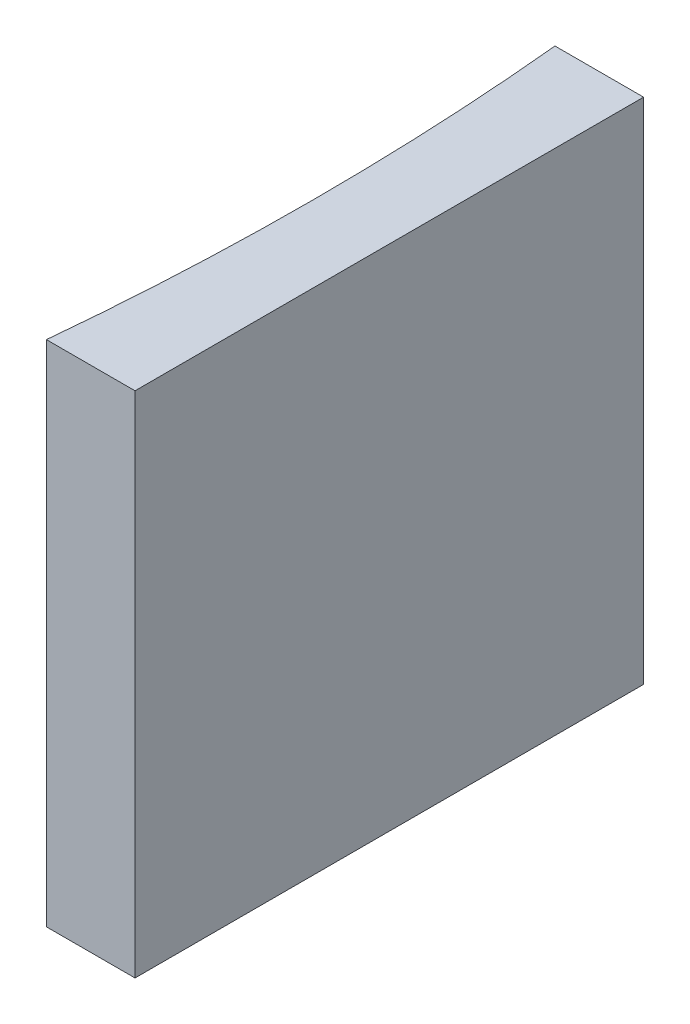
ISO-10303-21;
HEADER;
FILE_DESCRIPTION(('STEP AP214'),'2;1');
FILE_NAME('part.step','',(''),(''),'','','');
FILE_SCHEMA(('AUTOMOTIVE_DESIGN { 1 0 10303 214 1 1 1 1 }'));
ENDSEC;
DATA;
#1=APPLICATION_CONTEXT('core data for automotive mechanical design processes');
#2=APPLICATION_PROTOCOL_DEFINITION('international standard','automotive_design',2000,#1);
#3=PRODUCT_CONTEXT('',#1,'mechanical');
#4=PRODUCT('Part','Part','',(#3));
#5=PRODUCT_RELATED_PRODUCT_CATEGORY('part','',(#4));
#6=PRODUCT_DEFINITION_FORMATION('','',#4);
#7=PRODUCT_DEFINITION_CONTEXT('part definition',#1,'design');
#8=PRODUCT_DEFINITION('design','',#6,#7);
#9=PRODUCT_DEFINITION_SHAPE('','',#8);
#10=(LENGTH_UNIT() NAMED_UNIT(*) SI_UNIT(.MILLI.,.METRE.));
#11=(NAMED_UNIT(*) PLANE_ANGLE_UNIT() SI_UNIT($,.RADIAN.));
#12=(NAMED_UNIT(*) SI_UNIT($,.STERADIAN.) SOLID_ANGLE_UNIT());
#13=UNCERTAINTY_MEASURE_WITH_UNIT(LENGTH_MEASURE(1.E-05),#10,'distance_accuracy_value','');
#14=(GEOMETRIC_REPRESENTATION_CONTEXT(3) GLOBAL_UNCERTAINTY_ASSIGNED_CONTEXT((#13)) GLOBAL_UNIT_ASSIGNED_CONTEXT((#10,
#11,#12)) REPRESENTATION_CONTEXT('',''));
#15=CARTESIAN_POINT('',(0.,0.,0.));
#16=DIRECTION('',(0.,0.,1.));
#17=DIRECTION('',(1.,0.,0.));
#18=AXIS2_PLACEMENT_3D('',#15,#16,#17);
#19=CARTESIAN_POINT('',(0.,20.,0.));
#20=DIRECTION('',(0.,0.,1.));
#21=DIRECTION('',(1.,0.,0.));
#22=AXIS2_PLACEMENT_3D('',#19,#20,#21);
#23=PLANE('',#22);
#24=DIRECTION('',(-1.,0.,0.));
#25=VECTOR('',#24,1.);
#26=CARTESIAN_POINT('',(0.,0.,0.));
#27=LINE('',#26,#25);
#28=CARTESIAN_POINT('',(0.,0.,0.));
#29=VERTEX_POINT('',#28);
#30=CARTESIAN_POINT('',(-3.4846950157558,0.,0.));
#31=VERTEX_POINT('',#30);
#32=EDGE_CURVE('E100',#29,#31,#27,.T.);
#33=ORIENTED_EDGE('',*,*,#32,.T.);
#34=DIRECTION('',(0.,-1.,0.));
#35=VECTOR('',#34,1.);
#36=CARTESIAN_POINT('',(-3.4846950157558,20.,0.));
#37=LINE('',#36,#35);
#38=CARTESIAN_POINT('',(-3.4846950157558,20.,0.));
#39=VERTEX_POINT('',#38);
#40=EDGE_CURVE('E11',#39,#31,#37,.T.);
#41=ORIENTED_EDGE('',*,*,#40,.F.);
#42=DIRECTION('',(-1.,0.,0.));
#43=VECTOR('',#42,1.);
#44=CARTESIAN_POINT('',(0.,20.,0.));
#45=LINE('',#44,#43);
#46=CARTESIAN_POINT('',(0.,20.,0.));
#47=VERTEX_POINT('',#46);
#48=EDGE_CURVE('E88',#47,#39,#45,.T.);
#49=ORIENTED_EDGE('',*,*,#48,.F.);
#50=DIRECTION('',(0.,-1.,0.));
#51=VECTOR('',#50,1.);
#52=CARTESIAN_POINT('',(0.,20.,0.));
#53=LINE('',#52,#51);
#54=EDGE_CURVE('E96',#47,#29,#53,.T.);
#55=ORIENTED_EDGE('',*,*,#54,.T.);
#56=EDGE_LOOP('',(#33,#41,#49,#55));
#57=FACE_BOUND('',#56,.T.);
#58=ADVANCED_FACE('F37',(#57),#23,.F.);
#59=CARTESIAN_POINT('',(-106.4,20.,10.));
#60=DIRECTION('',(0.,-1.,0.));
#61=DIRECTION('',(0.,0.,-1.));
#62=AXIS2_PLACEMENT_3D('',#59,#60,#61);
#63=CYLINDRICAL_SURFACE('',#62,103.4);
#64=CARTESIAN_POINT('',(-106.4,0.,10.));
#65=DIRECTION('',(0.,-1.,0.));
#66=DIRECTION('',(0.,0.,1.));
#67=AXIS2_PLACEMENT_3D('',#64,#65,#66);
#68=CIRCLE('',#67,103.4);
#69=CARTESIAN_POINT('',(-3.4846950157558,0.,20.));
#70=VERTEX_POINT('',#69);
#71=EDGE_CURVE('E92',#31,#70,#68,.T.);
#72=ORIENTED_EDGE('',*,*,#71,.T.);
#73=DIRECTION('',(0.,-1.,0.));
#74=VECTOR('',#73,1.);
#75=CARTESIAN_POINT('',(-3.4846950157558,20.,20.));
#76=LINE('',#75,#74);
#77=CARTESIAN_POINT('',(-3.4846950157558,20.,20.));
#78=VERTEX_POINT('',#77);
#79=EDGE_CURVE('E45',#78,#70,#76,.T.);
#80=ORIENTED_EDGE('',*,*,#79,.F.);
#81=CARTESIAN_POINT('',(-106.4,20.,10.));
#82=DIRECTION('',(0.,-1.,0.));
#83=DIRECTION('',(0.,0.,1.));
#84=AXIS2_PLACEMENT_3D('',#81,#82,#83);
#85=CIRCLE('',#84,103.4);
#86=EDGE_CURVE('E83',#39,#78,#85,.T.);
#87=ORIENTED_EDGE('',*,*,#86,.F.);
#88=ORIENTED_EDGE('',*,*,#40,.T.);
#89=EDGE_LOOP('',(#72,#80,#87,#88));
#90=FACE_BOUND('',#89,.T.);
#91=ADVANCED_FACE('F91',(#90),#63,.F.);
#92=CARTESIAN_POINT('',(0.,20.,20.));
#93=DIRECTION('',(0.,0.,-1.));
#94=DIRECTION('',(-1.,0.,0.));
#95=AXIS2_PLACEMENT_3D('',#92,#93,#94);
#96=PLANE('',#95);
#97=DIRECTION('',(1.,0.,0.));
#98=VECTOR('',#97,1.);
#99=CARTESIAN_POINT('',(0.,0.,20.));
#100=LINE('',#99,#98);
#101=CARTESIAN_POINT('',(0.,0.,20.));
#102=VERTEX_POINT('',#101);
#103=EDGE_CURVE('E70',#70,#102,#100,.T.);
#104=ORIENTED_EDGE('',*,*,#103,.T.);
#105=DIRECTION('',(0.,-1.,0.));
#106=VECTOR('',#105,1.);
#107=CARTESIAN_POINT('',(0.,20.,20.));
#108=LINE('',#107,#106);
#109=CARTESIAN_POINT('',(0.,20.,20.));
#110=VERTEX_POINT('',#109);
#111=EDGE_CURVE('E93',#110,#102,#108,.T.);
#112=ORIENTED_EDGE('',*,*,#111,.F.);
#113=DIRECTION('',(1.,0.,0.));
#114=VECTOR('',#113,1.);
#115=CARTESIAN_POINT('',(0.,20.,20.));
#116=LINE('',#115,#114);
#117=EDGE_CURVE('E86',#78,#110,#116,.T.);
#118=ORIENTED_EDGE('',*,*,#117,.F.);
#119=ORIENTED_EDGE('',*,*,#79,.T.);
#120=EDGE_LOOP('',(#104,#112,#118,#119));
#121=FACE_BOUND('',#120,.T.);
#122=ADVANCED_FACE('F94',(#121),#96,.F.);
#123=CARTESIAN_POINT('',(0.,20.,0.));
#124=DIRECTION('',(-1.,0.,0.));
#125=DIRECTION('',(0.,0.,1.));
#126=AXIS2_PLACEMENT_3D('',#123,#124,#125);
#127=PLANE('',#126);
#128=DIRECTION('',(0.,0.,-1.));
#129=VECTOR('',#128,1.);
#130=CARTESIAN_POINT('',(0.,0.,0.));
#131=LINE('',#130,#129);
#132=EDGE_CURVE('E76',#102,#29,#131,.T.);
#133=ORIENTED_EDGE('',*,*,#132,.T.);
#134=ORIENTED_EDGE('',*,*,#54,.F.);
#135=DIRECTION('',(0.,0.,-1.));
#136=VECTOR('',#135,1.);
#137=CARTESIAN_POINT('',(0.,20.,0.));
#138=LINE('',#137,#136);
#139=EDGE_CURVE('E53',#110,#47,#138,.T.);
#140=ORIENTED_EDGE('',*,*,#139,.F.);
#141=ORIENTED_EDGE('',*,*,#111,.T.);
#142=EDGE_LOOP('',(#133,#134,#140,#141));
#143=FACE_BOUND('',#142,.T.);
#144=ADVANCED_FACE('F107',(#143),#127,.F.);
#145=CARTESIAN_POINT('',(-106.4,20.,10.));
#146=DIRECTION('',(0.,1.,0.));
#147=DIRECTION('',(0.,0.,1.));
#148=AXIS2_PLACEMENT_3D('',#145,#146,#147);
#149=PLANE('',#148);
#150=ORIENTED_EDGE('',*,*,#48,.T.);
#151=ORIENTED_EDGE('',*,*,#86,.T.);
#152=ORIENTED_EDGE('',*,*,#117,.T.);
#153=ORIENTED_EDGE('',*,*,#139,.T.);
#154=EDGE_LOOP('',(#150,#151,#152,#153));
#155=FACE_BOUND('',#154,.T.);
#156=ADVANCED_FACE('F84',(#155),#149,.T.);
#157=CARTESIAN_POINT('',(-106.4,0.,10.));
#158=DIRECTION('',(0.,1.,0.));
#159=DIRECTION('',(0.,0.,1.));
#160=AXIS2_PLACEMENT_3D('',#157,#158,#159);
#161=PLANE('',#160);
#162=ORIENTED_EDGE('',*,*,#32,.F.);
#163=ORIENTED_EDGE('',*,*,#132,.F.);
#164=ORIENTED_EDGE('',*,*,#103,.F.);
#165=ORIENTED_EDGE('',*,*,#71,.F.);
#166=EDGE_LOOP('',(#162,#163,#164,#165));
#167=FACE_BOUND('',#166,.T.);
#168=ADVANCED_FACE('F110',(#167),#161,.F.);
#169=CLOSED_SHELL('',(#58,#91,#122,#144,#156,#168));
#170=MANIFOLD_SOLID_BREP('B2',#169);
#171=ADVANCED_BREP_SHAPE_REPRESENTATION('',(#18,#170),#14);
#172=SHAPE_DEFINITION_REPRESENTATION(#9,#171);
ENDSEC;
END-ISO-10303-21;
